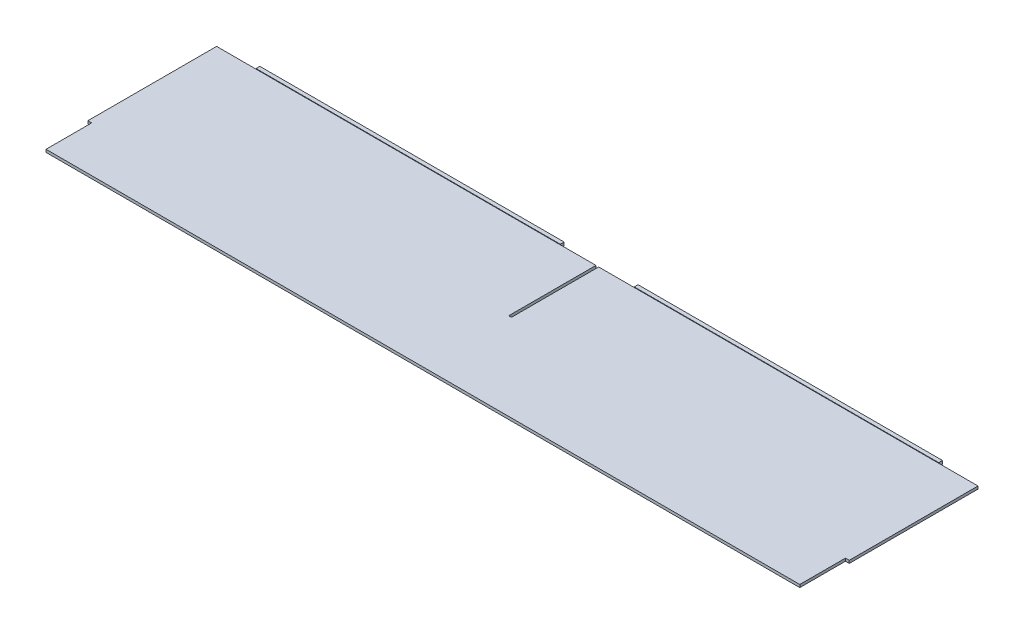
ISO-10303-21;
HEADER;
FILE_DESCRIPTION(('STEP AP214'),'2;1');
FILE_NAME('part.step','',(''),(''),'','','');
FILE_SCHEMA(('AUTOMOTIVE_DESIGN { 1 0 10303 214 1 1 1 1 }'));
ENDSEC;
DATA;
#1=APPLICATION_CONTEXT('core data for automotive mechanical design processes');
#2=APPLICATION_PROTOCOL_DEFINITION('international standard','automotive_design',2000,#1);
#3=PRODUCT_CONTEXT('',#1,'mechanical');
#4=PRODUCT('Part','Part','',(#3));
#5=PRODUCT_RELATED_PRODUCT_CATEGORY('part','',(#4));
#6=PRODUCT_DEFINITION_FORMATION('','',#4);
#7=PRODUCT_DEFINITION_CONTEXT('part definition',#1,'design');
#8=PRODUCT_DEFINITION('design','',#6,#7);
#9=PRODUCT_DEFINITION_SHAPE('','',#8);
#10=(LENGTH_UNIT() NAMED_UNIT(*) SI_UNIT(.MILLI.,.METRE.));
#11=(NAMED_UNIT(*) PLANE_ANGLE_UNIT() SI_UNIT($,.RADIAN.));
#12=(NAMED_UNIT(*) SI_UNIT($,.STERADIAN.) SOLID_ANGLE_UNIT());
#13=UNCERTAINTY_MEASURE_WITH_UNIT(LENGTH_MEASURE(1.E-05),#10,'distance_accuracy_value','');
#14=(GEOMETRIC_REPRESENTATION_CONTEXT(3) GLOBAL_UNCERTAINTY_ASSIGNED_CONTEXT((#13)) GLOBAL_UNIT_ASSIGNED_CONTEXT((#10,
#11,#12)) REPRESENTATION_CONTEXT('',''));
#15=CARTESIAN_POINT('',(0.,0.,0.));
#16=DIRECTION('',(0.,0.,1.));
#17=DIRECTION('',(1.,0.,0.));
#18=AXIS2_PLACEMENT_3D('',#15,#16,#17);
#19=CARTESIAN_POINT('',(-317.6778,1.143,-72.771));
#20=DIRECTION('',(0.,0.,1.));
#21=DIRECTION('',(1.,0.,0.));
#22=AXIS2_PLACEMENT_3D('',#19,#20,#21);
#23=PLANE('',#22);
#24=DIRECTION('',(-1.,0.,0.));
#25=VECTOR('',#24,1.);
#26=CARTESIAN_POINT('',(-317.6778,1.143,-72.771));
#27=LINE('',#26,#25);
#28=CARTESIAN_POINT('',(-1.14299999999998,1.143,-72.771));
#29=VERTEX_POINT('',#28);
#30=CARTESIAN_POINT('',(-30.8229000000015,1.143,-72.771));
#31=VERTEX_POINT('',#30);
#32=EDGE_CURVE('E204',#29,#31,#27,.T.);
#33=ORIENTED_EDGE('',*,*,#32,.F.);
#34=DIRECTION('',(0.,-1.,0.));
#35=VECTOR('',#34,1.);
#36=CARTESIAN_POINT('',(-1.14300000000001,1.143,-72.771));
#37=LINE('',#36,#35);
#38=CARTESIAN_POINT('',(-1.14299999999998,-1.143,-72.771));
#39=VERTEX_POINT('',#38);
#40=EDGE_CURVE('E11',#29,#39,#37,.T.);
#41=ORIENTED_EDGE('',*,*,#40,.T.);
#42=DIRECTION('',(-1.,0.,0.));
#43=VECTOR('',#42,1.);
#44=CARTESIAN_POINT('',(-317.6778,-1.143,-72.771));
#45=LINE('',#44,#43);
#46=CARTESIAN_POINT('',(-30.8229000000015,-1.143,-72.771));
#47=VERTEX_POINT('',#46);
#48=EDGE_CURVE('E202',#39,#47,#45,.T.);
#49=ORIENTED_EDGE('',*,*,#48,.T.);
#50=DIRECTION('',(0.,-1.,0.));
#51=VECTOR('',#50,1.);
#52=CARTESIAN_POINT('',(-30.8229000000015,-1.143,-72.771));
#53=LINE('',#52,#51);
#54=EDGE_CURVE('E236',#31,#47,#53,.T.);
#55=ORIENTED_EDGE('',*,*,#54,.F.);
#56=EDGE_LOOP('',(#33,#41,#49,#55));
#57=FACE_BOUND('',#56,.T.);
#58=ADVANCED_FACE('F38',(#57),#23,.F.);
#59=CARTESIAN_POINT('',(317.6778,1.143,-72.771));
#60=DIRECTION('',(-1.,0.,0.));
#61=DIRECTION('',(0.,0.,1.));
#62=AXIS2_PLACEMENT_3D('',#59,#60,#61);
#63=PLANE('',#62);
#64=DIRECTION('',(0.,-1.,0.));
#65=VECTOR('',#64,1.);
#66=CARTESIAN_POINT('',(317.6778,1.58749999999994,34.671));
#67=LINE('',#66,#65);
#68=CARTESIAN_POINT('',(317.6778,1.143,34.671));
#69=VERTEX_POINT('',#68);
#70=CARTESIAN_POINT('',(317.6778,-1.143,34.671));
#71=VERTEX_POINT('',#70);
#72=EDGE_CURVE('E302',#69,#71,#67,.T.);
#73=ORIENTED_EDGE('',*,*,#72,.T.);
#74=DIRECTION('',(0.,0.,-1.));
#75=VECTOR('',#74,1.);
#76=CARTESIAN_POINT('',(317.6778,-1.143,-72.771));
#77=LINE('',#76,#75);
#78=CARTESIAN_POINT('',(317.6778,-1.143,-72.771));
#79=VERTEX_POINT('',#78);
#80=EDGE_CURVE('E214',#71,#79,#77,.T.);
#81=ORIENTED_EDGE('',*,*,#80,.T.);
#82=DIRECTION('',(0.,-1.,0.));
#83=VECTOR('',#82,1.);
#84=CARTESIAN_POINT('',(317.6778,1.143,-72.771));
#85=LINE('',#84,#83);
#86=CARTESIAN_POINT('',(317.6778,1.143,-72.771));
#87=VERTEX_POINT('',#86);
#88=EDGE_CURVE('E234',#87,#79,#85,.T.);
#89=ORIENTED_EDGE('',*,*,#88,.F.);
#90=DIRECTION('',(0.,0.,-1.));
#91=VECTOR('',#90,1.);
#92=CARTESIAN_POINT('',(317.6778,1.143,-72.771));
#93=LINE('',#92,#91);
#94=EDGE_CURVE('E229',#69,#87,#93,.T.);
#95=ORIENTED_EDGE('',*,*,#94,.F.);
#96=EDGE_LOOP('',(#73,#81,#89,#95));
#97=FACE_BOUND('',#96,.T.);
#98=ADVANCED_FACE('F40',(#97),#63,.F.);
#99=CARTESIAN_POINT('',(-317.6778,1.143,72.771));
#100=DIRECTION('',(0.,0.,-1.));
#101=DIRECTION('',(-1.,0.,0.));
#102=AXIS2_PLACEMENT_3D('',#99,#100,#101);
#103=PLANE('',#102);
#104=DIRECTION('',(0.,-1.,0.));
#105=VECTOR('',#104,1.);
#106=CARTESIAN_POINT('',(314.5028,1.58749999999994,72.771));
#107=LINE('',#106,#105);
#108=CARTESIAN_POINT('',(314.5028,1.143,72.771));
#109=VERTEX_POINT('',#108);
#110=CARTESIAN_POINT('',(314.5028,-1.143,72.771));
#111=VERTEX_POINT('',#110);
#112=EDGE_CURVE('E61',#109,#111,#107,.T.);
#113=ORIENTED_EDGE('',*,*,#112,.F.);
#114=DIRECTION('',(1.,0.,0.));
#115=VECTOR('',#114,1.);
#116=CARTESIAN_POINT('',(-317.6778,1.143,72.771));
#117=LINE('',#116,#115);
#118=CARTESIAN_POINT('',(-314.5028,1.143,72.771));
#119=VERTEX_POINT('',#118);
#120=EDGE_CURVE('E235',#119,#109,#117,.T.);
#121=ORIENTED_EDGE('',*,*,#120,.F.);
#122=DIRECTION('',(0.,-1.,0.));
#123=VECTOR('',#122,1.);
#124=CARTESIAN_POINT('',(-314.5028,1.58749999999994,72.771));
#125=LINE('',#124,#123);
#126=CARTESIAN_POINT('',(-314.5028,-1.143,72.771));
#127=VERTEX_POINT('',#126);
#128=EDGE_CURVE('E326',#119,#127,#125,.T.);
#129=ORIENTED_EDGE('',*,*,#128,.T.);
#130=DIRECTION('',(1.,0.,0.));
#131=VECTOR('',#130,1.);
#132=CARTESIAN_POINT('',(-317.6778,-1.143,72.771));
#133=LINE('',#132,#131);
#134=EDGE_CURVE('E223',#127,#111,#133,.T.);
#135=ORIENTED_EDGE('',*,*,#134,.T.);
#136=EDGE_LOOP('',(#113,#121,#129,#135));
#137=FACE_BOUND('',#136,.T.);
#138=ADVANCED_FACE('F401',(#137),#103,.F.);
#139=CARTESIAN_POINT('',(0.,1.143,0.));
#140=DIRECTION('',(0.,1.,0.));
#141=DIRECTION('',(0.,0.,1.));
#142=AXIS2_PLACEMENT_3D('',#139,#140,#141);
#143=PLANE('',#142);
#144=DIRECTION('',(0.,0.,1.));
#145=VECTOR('',#144,1.);
#146=CARTESIAN_POINT('',(-1.14299999999998,1.143,0.));
#147=LINE('',#146,#145);
#148=CARTESIAN_POINT('',(-1.14299999999998,1.143,0.));
#149=VERTEX_POINT('',#148);
#150=EDGE_CURVE('E407',#29,#149,#147,.T.);
#151=ORIENTED_EDGE('',*,*,#150,.F.);
#152=ORIENTED_EDGE('',*,*,#32,.T.);
#153=CARTESIAN_POINT('',(-284.822900000001,1.143,-72.771));
#154=VERTEX_POINT('',#153);
#155=EDGE_CURVE('E293',#31,#154,#27,.T.);
#156=ORIENTED_EDGE('',*,*,#155,.T.);
#157=CARTESIAN_POINT('',(-317.6778,1.143,-72.771));
#158=VERTEX_POINT('',#157);
#159=EDGE_CURVE('E287',#154,#158,#27,.T.);
#160=ORIENTED_EDGE('',*,*,#159,.T.);
#161=DIRECTION('',(0.,0.,1.));
#162=VECTOR('',#161,1.);
#163=CARTESIAN_POINT('',(-317.6778,1.143,-72.771));
#164=LINE('',#163,#162);
#165=CARTESIAN_POINT('',(-317.6778,1.143,34.671));
#166=VERTEX_POINT('',#165);
#167=EDGE_CURVE('E291',#158,#166,#164,.T.);
#168=ORIENTED_EDGE('',*,*,#167,.T.);
#169=DIRECTION('',(-1.,0.,0.));
#170=VECTOR('',#169,1.);
#171=CARTESIAN_POINT('',(0.,1.143,34.671));
#172=LINE('',#171,#170);
#173=CARTESIAN_POINT('',(-314.5028,1.143,34.671));
#174=VERTEX_POINT('',#173);
#175=EDGE_CURVE('E329',#174,#166,#172,.T.);
#176=ORIENTED_EDGE('',*,*,#175,.F.);
#177=DIRECTION('',(0.,0.,-1.));
#178=VECTOR('',#177,1.);
#179=CARTESIAN_POINT('',(-314.5028,1.143,0.));
#180=LINE('',#179,#178);
#181=EDGE_CURVE('E334',#119,#174,#180,.T.);
#182=ORIENTED_EDGE('',*,*,#181,.F.);
#183=ORIENTED_EDGE('',*,*,#120,.T.);
#184=DIRECTION('',(0.,0.,-1.));
#185=VECTOR('',#184,1.);
#186=CARTESIAN_POINT('',(314.5028,1.143,0.));
#187=LINE('',#186,#185);
#188=CARTESIAN_POINT('',(314.5028,1.143,34.671));
#189=VERTEX_POINT('',#188);
#190=EDGE_CURVE('E313',#109,#189,#187,.T.);
#191=ORIENTED_EDGE('',*,*,#190,.T.);
#192=DIRECTION('',(1.,0.,0.));
#193=VECTOR('',#192,1.);
#194=CARTESIAN_POINT('',(0.,1.143,34.671));
#195=LINE('',#194,#193);
#196=EDGE_CURVE('E312',#189,#69,#195,.T.);
#197=ORIENTED_EDGE('',*,*,#196,.T.);
#198=ORIENTED_EDGE('',*,*,#94,.T.);
#199=CARTESIAN_POINT('',(284.822900000001,1.143,-72.771));
#200=VERTEX_POINT('',#199);
#201=EDGE_CURVE('E288',#87,#200,#27,.T.);
#202=ORIENTED_EDGE('',*,*,#201,.T.);
#203=DIRECTION('',(1.,0.,0.));
#204=VECTOR('',#203,1.);
#205=CARTESIAN_POINT('',(0.,1.143,-72.771));
#206=LINE('',#205,#204);
#207=CARTESIAN_POINT('',(30.8229000000014,1.143,-72.771));
#208=VERTEX_POINT('',#207);
#209=EDGE_CURVE('E246',#208,#200,#206,.T.);
#210=ORIENTED_EDGE('',*,*,#209,.F.);
#211=CARTESIAN_POINT('',(1.14300000000001,1.143,-72.771));
#212=VERTEX_POINT('',#211);
#213=EDGE_CURVE('E292',#208,#212,#27,.T.);
#214=ORIENTED_EDGE('',*,*,#213,.T.);
#215=DIRECTION('',(0.,0.,-1.));
#216=VECTOR('',#215,1.);
#217=CARTESIAN_POINT('',(1.14300000000002,1.143,0.));
#218=LINE('',#217,#216);
#219=CARTESIAN_POINT('',(1.14300000000002,1.143,0.));
#220=VERTEX_POINT('',#219);
#221=EDGE_CURVE('E53',#220,#212,#218,.T.);
#222=ORIENTED_EDGE('',*,*,#221,.F.);
#223=DIRECTION('',(1.,0.,0.));
#224=VECTOR('',#223,1.);
#225=CARTESIAN_POINT('',(0.,1.143,0.));
#226=LINE('',#225,#224);
#227=EDGE_CURVE('E404',#149,#220,#226,.T.);
#228=ORIENTED_EDGE('',*,*,#227,.F.);
#229=EDGE_LOOP('',(#151,#152,#156,#160,#168,#176,#182,#183,#191,#197,#198,#202,#210,#214,#222,#228));
#230=FACE_BOUND('',#229,.T.);
#231=ADVANCED_FACE('F309',(#230),#143,.T.);
#232=CARTESIAN_POINT('',(0.,-1.143,0.));
#233=DIRECTION('',(0.,1.,0.));
#234=DIRECTION('',(0.,0.,1.));
#235=AXIS2_PLACEMENT_3D('',#232,#233,#234);
#236=PLANE('',#235);
#237=ORIENTED_EDGE('',*,*,#48,.F.);
#238=DIRECTION('',(0.,0.,-1.));
#239=VECTOR('',#238,1.);
#240=CARTESIAN_POINT('',(-1.14299999999998,-1.143,-72.771));
#241=LINE('',#240,#239);
#242=CARTESIAN_POINT('',(-1.14299999999998,-1.143,0.));
#243=VERTEX_POINT('',#242);
#244=EDGE_CURVE('E188',#243,#39,#241,.T.);
#245=ORIENTED_EDGE('',*,*,#244,.F.);
#246=DIRECTION('',(-1.,0.,0.));
#247=VECTOR('',#246,1.);
#248=CARTESIAN_POINT('',(-1.14299999999998,-1.143,0.));
#249=LINE('',#248,#247);
#250=CARTESIAN_POINT('',(1.14300000000002,-1.143,0.));
#251=VERTEX_POINT('',#250);
#252=EDGE_CURVE('E553',#251,#243,#249,.T.);
#253=ORIENTED_EDGE('',*,*,#252,.F.);
#254=DIRECTION('',(0.,0.,1.));
#255=VECTOR('',#254,1.);
#256=CARTESIAN_POINT('',(1.14300000000002,-1.143,-72.771));
#257=LINE('',#256,#255);
#258=CARTESIAN_POINT('',(1.14300000000002,-1.143,-72.771));
#259=VERTEX_POINT('',#258);
#260=EDGE_CURVE('E197',#259,#251,#257,.T.);
#261=ORIENTED_EDGE('',*,*,#260,.F.);
#262=CARTESIAN_POINT('',(30.8229000000015,-1.143,-72.771));
#263=VERTEX_POINT('',#262);
#264=EDGE_CURVE('E209',#263,#259,#45,.T.);
#265=ORIENTED_EDGE('',*,*,#264,.F.);
#266=DIRECTION('',(0.,0.,1.));
#267=VECTOR('',#266,1.);
#268=CARTESIAN_POINT('',(30.8229000000015,-1.143,-75.946));
#269=LINE('',#268,#267);
#270=CARTESIAN_POINT('',(30.8229000000015,-1.143,-75.946));
#271=VERTEX_POINT('',#270);
#272=EDGE_CURVE('E259',#271,#263,#269,.T.);
#273=ORIENTED_EDGE('',*,*,#272,.F.);
#274=DIRECTION('',(-1.,0.,0.));
#275=VECTOR('',#274,1.);
#276=CARTESIAN_POINT('',(284.822900000001,-1.143,-75.946));
#277=LINE('',#276,#275);
#278=CARTESIAN_POINT('',(284.822900000001,-1.143,-75.946));
#279=VERTEX_POINT('',#278);
#280=EDGE_CURVE('E339',#279,#271,#277,.T.);
#281=ORIENTED_EDGE('',*,*,#280,.F.);
#282=DIRECTION('',(0.,0.,1.));
#283=VECTOR('',#282,1.);
#284=CARTESIAN_POINT('',(284.822900000001,-1.143,-75.946));
#285=LINE('',#284,#283);
#286=CARTESIAN_POINT('',(284.822900000001,-1.143,-72.771));
#287=VERTEX_POINT('',#286);
#288=EDGE_CURVE('E251',#279,#287,#285,.T.);
#289=ORIENTED_EDGE('',*,*,#288,.T.);
#290=EDGE_CURVE('E212',#79,#287,#45,.T.);
#291=ORIENTED_EDGE('',*,*,#290,.F.);
#292=ORIENTED_EDGE('',*,*,#80,.F.);
#293=DIRECTION('',(-1.,0.,0.));
#294=VECTOR('',#293,1.);
#295=CARTESIAN_POINT('',(317.6778,-1.143,34.671));
#296=LINE('',#295,#294);
#297=CARTESIAN_POINT('',(314.5028,-1.143,34.671));
#298=VERTEX_POINT('',#297);
#299=EDGE_CURVE('E403',#71,#298,#296,.T.);
#300=ORIENTED_EDGE('',*,*,#299,.T.);
#301=DIRECTION('',(0.,0.,1.));
#302=VECTOR('',#301,1.);
#303=CARTESIAN_POINT('',(314.5028,-1.143,72.771));
#304=LINE('',#303,#302);
#305=EDGE_CURVE('E402',#298,#111,#304,.T.);
#306=ORIENTED_EDGE('',*,*,#305,.T.);
#307=ORIENTED_EDGE('',*,*,#134,.F.);
#308=DIRECTION('',(0.,0.,1.));
#309=VECTOR('',#308,1.);
#310=CARTESIAN_POINT('',(-314.5028,-1.143,72.771));
#311=LINE('',#310,#309);
#312=CARTESIAN_POINT('',(-314.5028,-1.143,34.671));
#313=VERTEX_POINT('',#312);
#314=EDGE_CURVE('E319',#313,#127,#311,.T.);
#315=ORIENTED_EDGE('',*,*,#314,.F.);
#316=DIRECTION('',(1.,0.,0.));
#317=VECTOR('',#316,1.);
#318=CARTESIAN_POINT('',(-317.6778,-1.143,34.671));
#319=LINE('',#318,#317);
#320=CARTESIAN_POINT('',(-317.6778,-1.143,34.671));
#321=VERTEX_POINT('',#320);
#322=EDGE_CURVE('E316',#321,#313,#319,.T.);
#323=ORIENTED_EDGE('',*,*,#322,.F.);
#324=DIRECTION('',(0.,0.,1.));
#325=VECTOR('',#324,1.);
#326=CARTESIAN_POINT('',(-317.6778,-1.143,-72.771));
#327=LINE('',#326,#325);
#328=CARTESIAN_POINT('',(-317.6778,-1.143,-72.771));
#329=VERTEX_POINT('',#328);
#330=EDGE_CURVE('E217',#329,#321,#327,.T.);
#331=ORIENTED_EDGE('',*,*,#330,.F.);
#332=CARTESIAN_POINT('',(-284.822900000001,-1.143,-72.771));
#333=VERTEX_POINT('',#332);
#334=EDGE_CURVE('E210',#333,#329,#45,.T.);
#335=ORIENTED_EDGE('',*,*,#334,.F.);
#336=DIRECTION('',(0.,0.,1.));
#337=VECTOR('',#336,1.);
#338=CARTESIAN_POINT('',(-284.822900000001,-1.143,-75.946));
#339=LINE('',#338,#337);
#340=CARTESIAN_POINT('',(-284.822900000001,-1.143,-75.946));
#341=VERTEX_POINT('',#340);
#342=EDGE_CURVE('E279',#341,#333,#339,.T.);
#343=ORIENTED_EDGE('',*,*,#342,.F.);
#344=DIRECTION('',(-1.,0.,0.));
#345=VECTOR('',#344,1.);
#346=CARTESIAN_POINT('',(-30.8229000000015,-1.143,-75.946));
#347=LINE('',#346,#345);
#348=CARTESIAN_POINT('',(-30.8229000000015,-1.143,-75.946));
#349=VERTEX_POINT('',#348);
#350=EDGE_CURVE('E266',#349,#341,#347,.T.);
#351=ORIENTED_EDGE('',*,*,#350,.F.);
#352=DIRECTION('',(0.,0.,1.));
#353=VECTOR('',#352,1.);
#354=CARTESIAN_POINT('',(-30.8229000000015,-1.143,-75.946));
#355=LINE('',#354,#353);
#356=EDGE_CURVE('E208',#349,#47,#355,.T.);
#357=ORIENTED_EDGE('',*,*,#356,.T.);
#358=EDGE_LOOP('',(#237,#245,#253,#261,#265,#273,#281,#289,#291,#292,#300,#306,#307,#315,#323,
#331,#335,#343,#351,#357));
#359=FACE_BOUND('',#358,.T.);
#360=ADVANCED_FACE('F206',(#359),#236,.F.);
#361=DIRECTION('',(0.,-1.,0.));
#362=VECTOR('',#361,1.);
#363=CARTESIAN_POINT('',(284.822900000001,-1.143,-72.771));
#364=LINE('',#363,#362);
#365=EDGE_CURVE('E307',#200,#287,#364,.T.);
#366=ORIENTED_EDGE('',*,*,#365,.F.);
#367=ORIENTED_EDGE('',*,*,#201,.F.);
#368=ORIENTED_EDGE('',*,*,#88,.T.);
#369=ORIENTED_EDGE('',*,*,#290,.T.);
#370=EDGE_LOOP('',(#366,#367,#368,#369));
#371=FACE_BOUND('',#370,.T.);
#372=ADVANCED_FACE('F306',(#371),#23,.F.);
#373=ORIENTED_EDGE('',*,*,#264,.T.);
#374=DIRECTION('',(0.,1.,0.));
#375=VECTOR('',#374,1.);
#376=CARTESIAN_POINT('',(1.14300000000001,1.143,-72.771));
#377=LINE('',#376,#375);
#378=EDGE_CURVE('E46',#259,#212,#377,.T.);
#379=ORIENTED_EDGE('',*,*,#378,.T.);
#380=ORIENTED_EDGE('',*,*,#213,.F.);
#381=DIRECTION('',(0.,1.,0.));
#382=VECTOR('',#381,1.);
#383=CARTESIAN_POINT('',(30.8229000000015,1.58749999999994,-72.771));
#384=LINE('',#383,#382);
#385=EDGE_CURVE('E350',#263,#208,#384,.T.);
#386=ORIENTED_EDGE('',*,*,#385,.F.);
#387=EDGE_LOOP('',(#373,#379,#380,#386));
#388=FACE_BOUND('',#387,.T.);
#389=ADVANCED_FACE('F367',(#388),#23,.F.);
#390=DIRECTION('',(0.,1.,0.));
#391=VECTOR('',#390,1.);
#392=CARTESIAN_POINT('',(-284.822900000001,1.58749999999994,-72.771));
#393=LINE('',#392,#391);
#394=EDGE_CURVE('E249',#333,#154,#393,.T.);
#395=ORIENTED_EDGE('',*,*,#394,.F.);
#396=ORIENTED_EDGE('',*,*,#334,.T.);
#397=DIRECTION('',(0.,-1.,0.));
#398=VECTOR('',#397,1.);
#399=CARTESIAN_POINT('',(-317.6778,1.143,-72.771));
#400=LINE('',#399,#398);
#401=EDGE_CURVE('E232',#158,#329,#400,.T.);
#402=ORIENTED_EDGE('',*,*,#401,.F.);
#403=ORIENTED_EDGE('',*,*,#159,.F.);
#404=EDGE_LOOP('',(#395,#396,#402,#403));
#405=FACE_BOUND('',#404,.T.);
#406=ADVANCED_FACE('F374',(#405),#23,.F.);
#407=CARTESIAN_POINT('',(-317.6778,1.143,-72.771));
#408=DIRECTION('',(1.,0.,0.));
#409=DIRECTION('',(0.,0.,-1.));
#410=AXIS2_PLACEMENT_3D('',#407,#408,#409);
#411=PLANE('',#410);
#412=ORIENTED_EDGE('',*,*,#330,.T.);
#413=DIRECTION('',(0.,-1.,0.));
#414=VECTOR('',#413,1.);
#415=CARTESIAN_POINT('',(-317.6778,1.58749999999994,34.671));
#416=LINE('',#415,#414);
#417=EDGE_CURVE('E325',#166,#321,#416,.T.);
#418=ORIENTED_EDGE('',*,*,#417,.F.);
#419=ORIENTED_EDGE('',*,*,#167,.F.);
#420=ORIENTED_EDGE('',*,*,#401,.T.);
#421=EDGE_LOOP('',(#412,#418,#419,#420));
#422=FACE_BOUND('',#421,.T.);
#423=ADVANCED_FACE('F389',(#422),#411,.F.);
#424=CARTESIAN_POINT('',(0.,0.,-72.771));
#425=DIRECTION('',(0.,0.,1.));
#426=DIRECTION('',(1.,0.,0.));
#427=AXIS2_PLACEMENT_3D('',#424,#425,#426);
#428=PLANE('',#427);
#429=ORIENTED_EDGE('',*,*,#155,.F.);
#430=CARTESIAN_POINT('',(-30.8229000000015,1.58749999999994,-72.771));
#431=VERTEX_POINT('',#430);
#432=EDGE_CURVE('E240',#431,#31,#53,.T.);
#433=ORIENTED_EDGE('',*,*,#432,.F.);
#434=DIRECTION('',(1.,0.,0.));
#435=VECTOR('',#434,1.);
#436=CARTESIAN_POINT('',(-30.8229000000015,1.58749999999994,-72.771));
#437=LINE('',#436,#435);
#438=CARTESIAN_POINT('',(-284.822900000001,1.58749999999994,-72.771));
#439=VERTEX_POINT('',#438);
#440=EDGE_CURVE('E267',#439,#431,#437,.T.);
#441=ORIENTED_EDGE('',*,*,#440,.F.);
#442=EDGE_CURVE('E245',#154,#439,#393,.T.);
#443=ORIENTED_EDGE('',*,*,#442,.F.);
#444=EDGE_LOOP('',(#429,#433,#441,#443));
#445=FACE_BOUND('',#444,.T.);
#446=ADVANCED_FACE('F379',(#445),#428,.T.);
#447=CARTESIAN_POINT('',(-30.8229000000015,-1.143,-75.946));
#448=DIRECTION('',(-1.,0.,0.));
#449=DIRECTION('',(0.,0.,1.));
#450=AXIS2_PLACEMENT_3D('',#447,#448,#449);
#451=PLANE('',#450);
#452=ORIENTED_EDGE('',*,*,#432,.T.);
#453=ORIENTED_EDGE('',*,*,#54,.T.);
#454=ORIENTED_EDGE('',*,*,#356,.F.);
#455=DIRECTION('',(0.,-1.,0.));
#456=VECTOR('',#455,1.);
#457=CARTESIAN_POINT('',(-30.8229000000015,-1.143,-75.946));
#458=LINE('',#457,#456);
#459=CARTESIAN_POINT('',(-30.8229000000015,1.58749999999994,-75.946));
#460=VERTEX_POINT('',#459);
#461=EDGE_CURVE('E263',#460,#349,#458,.T.);
#462=ORIENTED_EDGE('',*,*,#461,.F.);
#463=DIRECTION('',(0.,0.,1.));
#464=VECTOR('',#463,1.);
#465=CARTESIAN_POINT('',(-30.8229000000015,1.58749999999994,-75.946));
#466=LINE('',#465,#464);
#467=EDGE_CURVE('E271',#460,#431,#466,.T.);
#468=ORIENTED_EDGE('',*,*,#467,.T.);
#469=EDGE_LOOP('',(#452,#453,#454,#462,#468));
#470=FACE_BOUND('',#469,.T.);
#471=ADVANCED_FACE('F443',(#470),#451,.F.);
#472=CARTESIAN_POINT('',(-284.822900000001,1.58749999999994,-75.946));
#473=DIRECTION('',(1.,0.,0.));
#474=DIRECTION('',(0.,1.,0.));
#475=AXIS2_PLACEMENT_3D('',#472,#473,#474);
#476=PLANE('',#475);
#477=ORIENTED_EDGE('',*,*,#394,.T.);
#478=ORIENTED_EDGE('',*,*,#442,.T.);
#479=DIRECTION('',(0.,0.,1.));
#480=VECTOR('',#479,1.);
#481=CARTESIAN_POINT('',(-284.822900000001,1.58749999999994,-75.946));
#482=LINE('',#481,#480);
#483=CARTESIAN_POINT('',(-284.822900000001,1.58749999999994,-75.946));
#484=VERTEX_POINT('',#483);
#485=EDGE_CURVE('E275',#484,#439,#482,.T.);
#486=ORIENTED_EDGE('',*,*,#485,.F.);
#487=DIRECTION('',(0.,1.,0.));
#488=VECTOR('',#487,1.);
#489=CARTESIAN_POINT('',(-284.822900000001,1.58749999999994,-75.946));
#490=LINE('',#489,#488);
#491=EDGE_CURVE('E269',#341,#484,#490,.T.);
#492=ORIENTED_EDGE('',*,*,#491,.F.);
#493=ORIENTED_EDGE('',*,*,#342,.T.);
#494=EDGE_LOOP('',(#477,#478,#486,#492,#493));
#495=FACE_BOUND('',#494,.T.);
#496=ADVANCED_FACE('F382',(#495),#476,.F.);
#497=CARTESIAN_POINT('',(-30.8229000000015,1.58749999999994,-75.946));
#498=DIRECTION('',(0.,-1.,0.));
#499=DIRECTION('',(0.,0.,-1.));
#500=AXIS2_PLACEMENT_3D('',#497,#498,#499);
#501=PLANE('',#500);
#502=ORIENTED_EDGE('',*,*,#440,.T.);
#503=ORIENTED_EDGE('',*,*,#467,.F.);
#504=DIRECTION('',(1.,0.,0.));
#505=VECTOR('',#504,1.);
#506=CARTESIAN_POINT('',(-30.8229000000015,1.58749999999994,-75.946));
#507=LINE('',#506,#505);
#508=EDGE_CURVE('E270',#484,#460,#507,.T.);
#509=ORIENTED_EDGE('',*,*,#508,.F.);
#510=ORIENTED_EDGE('',*,*,#485,.T.);
#511=EDGE_LOOP('',(#502,#503,#509,#510));
#512=FACE_BOUND('',#511,.T.);
#513=ADVANCED_FACE('F386',(#512),#501,.F.);
#514=CARTESIAN_POINT('',(0.,0.,-75.946));
#515=DIRECTION('',(0.,0.,1.));
#516=DIRECTION('',(1.,0.,0.));
#517=AXIS2_PLACEMENT_3D('',#514,#515,#516);
#518=PLANE('',#517);
#519=ORIENTED_EDGE('',*,*,#461,.T.);
#520=ORIENTED_EDGE('',*,*,#350,.T.);
#521=ORIENTED_EDGE('',*,*,#491,.T.);
#522=ORIENTED_EDGE('',*,*,#508,.T.);
#523=EDGE_LOOP('',(#519,#520,#521,#522));
#524=FACE_BOUND('',#523,.T.);
#525=ADVANCED_FACE('F387',(#524),#518,.F.);
#526=CARTESIAN_POINT('',(284.822900000001,-1.143,-75.946));
#527=DIRECTION('',(-1.,0.,0.));
#528=DIRECTION('',(0.,-1.,0.));
#529=AXIS2_PLACEMENT_3D('',#526,#527,#528);
#530=PLANE('',#529);
#531=CARTESIAN_POINT('',(284.822900000001,1.58749999999994,-72.771));
#532=VERTEX_POINT('',#531);
#533=EDGE_CURVE('E347',#532,#200,#364,.T.);
#534=ORIENTED_EDGE('',*,*,#533,.T.);
#535=ORIENTED_EDGE('',*,*,#365,.T.);
#536=ORIENTED_EDGE('',*,*,#288,.F.);
#537=DIRECTION('',(0.,-1.,0.));
#538=VECTOR('',#537,1.);
#539=CARTESIAN_POINT('',(284.822900000001,-1.143,-75.946));
#540=LINE('',#539,#538);
#541=CARTESIAN_POINT('',(284.822900000001,1.58749999999994,-75.946));
#542=VERTEX_POINT('',#541);
#543=EDGE_CURVE('E336',#542,#279,#540,.T.);
#544=ORIENTED_EDGE('',*,*,#543,.F.);
#545=DIRECTION('',(0.,0.,1.));
#546=VECTOR('',#545,1.);
#547=CARTESIAN_POINT('',(284.822900000001,1.58749999999994,-75.946));
#548=LINE('',#547,#546);
#549=EDGE_CURVE('E346',#542,#532,#548,.T.);
#550=ORIENTED_EDGE('',*,*,#549,.T.);
#551=EDGE_LOOP('',(#534,#535,#536,#544,#550));
#552=FACE_BOUND('',#551,.T.);
#553=ADVANCED_FACE('F458',(#552),#530,.F.);
#554=CARTESIAN_POINT('',(30.8229000000015,1.58749999999994,-75.946));
#555=DIRECTION('',(1.,0.,0.));
#556=DIRECTION('',(0.,0.,-1.));
#557=AXIS2_PLACEMENT_3D('',#554,#555,#556);
#558=PLANE('',#557);
#559=ORIENTED_EDGE('',*,*,#385,.T.);
#560=CARTESIAN_POINT('',(30.8229000000015,1.58749999999994,-72.771));
#561=VERTEX_POINT('',#560);
#562=EDGE_CURVE('E349',#208,#561,#384,.T.);
#563=ORIENTED_EDGE('',*,*,#562,.T.);
#564=DIRECTION('',(0.,0.,1.));
#565=VECTOR('',#564,1.);
#566=CARTESIAN_POINT('',(30.8229000000015,1.58749999999994,-75.946));
#567=LINE('',#566,#565);
#568=CARTESIAN_POINT('',(30.8229000000015,1.58749999999994,-75.946));
#569=VERTEX_POINT('',#568);
#570=EDGE_CURVE('E356',#569,#561,#567,.T.);
#571=ORIENTED_EDGE('',*,*,#570,.F.);
#572=DIRECTION('',(0.,1.,0.));
#573=VECTOR('',#572,1.);
#574=CARTESIAN_POINT('',(30.8229000000015,1.58749999999994,-75.946));
#575=LINE('',#574,#573);
#576=EDGE_CURVE('E342',#271,#569,#575,.T.);
#577=ORIENTED_EDGE('',*,*,#576,.F.);
#578=ORIENTED_EDGE('',*,*,#272,.T.);
#579=EDGE_LOOP('',(#559,#563,#571,#577,#578));
#580=FACE_BOUND('',#579,.T.);
#581=ADVANCED_FACE('F362',(#580),#558,.F.);
#582=CARTESIAN_POINT('',(284.822900000001,1.58749999999994,-75.946));
#583=DIRECTION('',(0.,-1.,0.));
#584=DIRECTION('',(0.,0.,-1.));
#585=AXIS2_PLACEMENT_3D('',#582,#583,#584);
#586=PLANE('',#585);
#587=DIRECTION('',(1.,0.,0.));
#588=VECTOR('',#587,1.);
#589=CARTESIAN_POINT('',(284.822900000001,1.58749999999994,-72.771));
#590=LINE('',#589,#588);
#591=EDGE_CURVE('E340',#561,#532,#590,.T.);
#592=ORIENTED_EDGE('',*,*,#591,.T.);
#593=ORIENTED_EDGE('',*,*,#549,.F.);
#594=DIRECTION('',(1.,0.,0.));
#595=VECTOR('',#594,1.);
#596=CARTESIAN_POINT('',(284.822900000001,1.58749999999994,-75.946));
#597=LINE('',#596,#595);
#598=EDGE_CURVE('E344',#569,#542,#597,.T.);
#599=ORIENTED_EDGE('',*,*,#598,.F.);
#600=ORIENTED_EDGE('',*,*,#570,.T.);
#601=EDGE_LOOP('',(#592,#593,#599,#600));
#602=FACE_BOUND('',#601,.T.);
#603=ADVANCED_FACE('F464',(#602),#586,.F.);
#604=CARTESIAN_POINT('',(0.,0.,-75.946));
#605=DIRECTION('',(0.,0.,1.));
#606=DIRECTION('',(1.,0.,0.));
#607=AXIS2_PLACEMENT_3D('',#604,#605,#606);
#608=PLANE('',#607);
#609=ORIENTED_EDGE('',*,*,#543,.T.);
#610=ORIENTED_EDGE('',*,*,#280,.T.);
#611=ORIENTED_EDGE('',*,*,#576,.T.);
#612=ORIENTED_EDGE('',*,*,#598,.T.);
#613=EDGE_LOOP('',(#609,#610,#611,#612));
#614=FACE_BOUND('',#613,.T.);
#615=ADVANCED_FACE('F467',(#614),#608,.F.);
#616=CARTESIAN_POINT('',(0.,0.,-72.771));
#617=DIRECTION('',(0.,0.,1.));
#618=DIRECTION('',(1.,0.,0.));
#619=AXIS2_PLACEMENT_3D('',#616,#617,#618);
#620=PLANE('',#619);
#621=ORIENTED_EDGE('',*,*,#562,.F.);
#622=ORIENTED_EDGE('',*,*,#209,.T.);
#623=ORIENTED_EDGE('',*,*,#533,.F.);
#624=ORIENTED_EDGE('',*,*,#591,.F.);
#625=EDGE_LOOP('',(#621,#622,#623,#624));
#626=FACE_BOUND('',#625,.T.);
#627=ADVANCED_FACE('F469',(#626),#620,.T.);
#628=CARTESIAN_POINT('',(-314.5028,1.58749999999994,72.771));
#629=DIRECTION('',(1.,0.,0.));
#630=DIRECTION('',(0.,0.,-1.));
#631=AXIS2_PLACEMENT_3D('',#628,#629,#630);
#632=PLANE('',#631);
#633=ORIENTED_EDGE('',*,*,#181,.T.);
#634=DIRECTION('',(0.,-1.,0.));
#635=VECTOR('',#634,1.);
#636=CARTESIAN_POINT('',(-314.5028,1.58749999999994,34.671));
#637=LINE('',#636,#635);
#638=EDGE_CURVE('E330',#174,#313,#637,.T.);
#639=ORIENTED_EDGE('',*,*,#638,.T.);
#640=ORIENTED_EDGE('',*,*,#314,.T.);
#641=ORIENTED_EDGE('',*,*,#128,.F.);
#642=EDGE_LOOP('',(#633,#639,#640,#641));
#643=FACE_BOUND('',#642,.T.);
#644=ADVANCED_FACE('F398',(#643),#632,.F.);
#645=CARTESIAN_POINT('',(-317.6778,1.58749999999994,34.671));
#646=DIRECTION('',(0.,0.,-1.));
#647=DIRECTION('',(-1.,0.,0.));
#648=AXIS2_PLACEMENT_3D('',#645,#646,#647);
#649=PLANE('',#648);
#650=ORIENTED_EDGE('',*,*,#175,.T.);
#651=ORIENTED_EDGE('',*,*,#417,.T.);
#652=ORIENTED_EDGE('',*,*,#322,.T.);
#653=ORIENTED_EDGE('',*,*,#638,.F.);
#654=EDGE_LOOP('',(#650,#651,#652,#653));
#655=FACE_BOUND('',#654,.T.);
#656=ADVANCED_FACE('F395',(#655),#649,.F.);
#657=CARTESIAN_POINT('',(317.6778,1.58749999999994,34.671));
#658=DIRECTION('',(0.,0.,1.));
#659=DIRECTION('',(1.,0.,0.));
#660=AXIS2_PLACEMENT_3D('',#657,#658,#659);
#661=PLANE('',#660);
#662=DIRECTION('',(0.,-1.,0.));
#663=VECTOR('',#662,1.);
#664=CARTESIAN_POINT('',(314.5028,1.58749999999994,34.671));
#665=LINE('',#664,#663);
#666=EDGE_CURVE('E412',#189,#298,#665,.T.);
#667=ORIENTED_EDGE('',*,*,#666,.T.);
#668=ORIENTED_EDGE('',*,*,#299,.F.);
#669=ORIENTED_EDGE('',*,*,#72,.F.);
#670=ORIENTED_EDGE('',*,*,#196,.F.);
#671=EDGE_LOOP('',(#667,#668,#669,#670));
#672=FACE_BOUND('',#671,.T.);
#673=ADVANCED_FACE('F413',(#672),#661,.T.);
#674=CARTESIAN_POINT('',(314.5028,1.58749999999994,72.771));
#675=DIRECTION('',(1.,0.,0.));
#676=DIRECTION('',(0.,0.,-1.));
#677=AXIS2_PLACEMENT_3D('',#674,#675,#676);
#678=PLANE('',#677);
#679=ORIENTED_EDGE('',*,*,#112,.T.);
#680=ORIENTED_EDGE('',*,*,#305,.F.);
#681=ORIENTED_EDGE('',*,*,#666,.F.);
#682=ORIENTED_EDGE('',*,*,#190,.F.);
#683=EDGE_LOOP('',(#679,#680,#681,#682));
#684=FACE_BOUND('',#683,.T.);
#685=ADVANCED_FACE('F414',(#684),#678,.T.);
#686=CARTESIAN_POINT('',(-1.14299999999998,1.58749999999994,-72.771));
#687=DIRECTION('',(-1.,0.,0.));
#688=DIRECTION('',(0.,0.,1.));
#689=AXIS2_PLACEMENT_3D('',#686,#687,#688);
#690=PLANE('',#689);
#691=ORIENTED_EDGE('',*,*,#150,.T.);
#692=DIRECTION('',(0.,-1.,0.));
#693=VECTOR('',#692,1.);
#694=CARTESIAN_POINT('',(-1.14299999999998,1.58749999999994,0.));
#695=LINE('',#694,#693);
#696=EDGE_CURVE('E192',#149,#243,#695,.T.);
#697=ORIENTED_EDGE('',*,*,#696,.T.);
#698=ORIENTED_EDGE('',*,*,#244,.T.);
#699=ORIENTED_EDGE('',*,*,#40,.F.);
#700=EDGE_LOOP('',(#691,#697,#698,#699));
#701=FACE_BOUND('',#700,.T.);
#702=ADVANCED_FACE('F189',(#701),#690,.F.);
#703=CARTESIAN_POINT('',(-1.14299999999998,1.58749999999994,0.));
#704=DIRECTION('',(0.,0.,1.));
#705=DIRECTION('',(1.,0.,0.));
#706=AXIS2_PLACEMENT_3D('',#703,#704,#705);
#707=PLANE('',#706);
#708=ORIENTED_EDGE('',*,*,#227,.T.);
#709=DIRECTION('',(0.,-1.,0.));
#710=VECTOR('',#709,1.);
#711=CARTESIAN_POINT('',(1.14300000000002,1.58749999999994,0.));
#712=LINE('',#711,#710);
#713=EDGE_CURVE('E552',#220,#251,#712,.T.);
#714=ORIENTED_EDGE('',*,*,#713,.T.);
#715=ORIENTED_EDGE('',*,*,#252,.T.);
#716=ORIENTED_EDGE('',*,*,#696,.F.);
#717=EDGE_LOOP('',(#708,#714,#715,#716));
#718=FACE_BOUND('',#717,.T.);
#719=ADVANCED_FACE('F421',(#718),#707,.F.);
#720=CARTESIAN_POINT('',(1.14300000000002,1.58749999999994,-72.771));
#721=DIRECTION('',(1.,0.,0.));
#722=DIRECTION('',(0.,0.,-1.));
#723=AXIS2_PLACEMENT_3D('',#720,#721,#722);
#724=PLANE('',#723);
#725=ORIENTED_EDGE('',*,*,#221,.T.);
#726=ORIENTED_EDGE('',*,*,#378,.F.);
#727=ORIENTED_EDGE('',*,*,#260,.T.);
#728=ORIENTED_EDGE('',*,*,#713,.F.);
#729=EDGE_LOOP('',(#725,#726,#727,#728));
#730=FACE_BOUND('',#729,.T.);
#731=ADVANCED_FACE('F538',(#730),#724,.F.);
#732=CLOSED_SHELL('',(#58,#98,#138,#231,#360,#372,#389,#406,#423,#446,#471,#496,#513,#525,#553,
#581,#603,#615,#627,#644,#656,#673,#685,#702,#719,#731));
#733=MANIFOLD_SOLID_BREP('B2',#732);
#734=ADVANCED_BREP_SHAPE_REPRESENTATION('',(#18,#733),#14);
#735=SHAPE_DEFINITION_REPRESENTATION(#9,#734);
ENDSEC;
END-ISO-10303-21;
